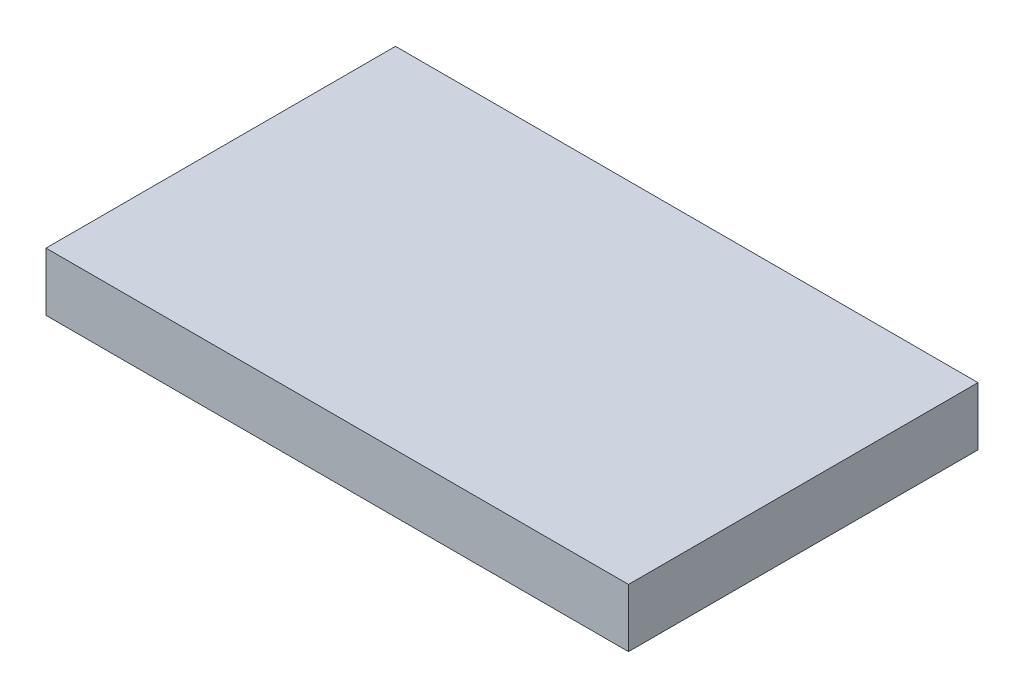
ISO-10303-21;
HEADER;
FILE_DESCRIPTION(('STEP AP214'),'2;1');
FILE_NAME('part.step','',(''),(''),'','','');
FILE_SCHEMA(('AUTOMOTIVE_DESIGN { 1 0 10303 214 1 1 1 1 }'));
ENDSEC;
DATA;
#1=APPLICATION_CONTEXT('core data for automotive mechanical design processes');
#2=APPLICATION_PROTOCOL_DEFINITION('international standard','automotive_design',2000,#1);
#3=PRODUCT_CONTEXT('',#1,'mechanical');
#4=PRODUCT('Part','Part','',(#3));
#5=PRODUCT_RELATED_PRODUCT_CATEGORY('part','',(#4));
#6=PRODUCT_DEFINITION_FORMATION('','',#4);
#7=PRODUCT_DEFINITION_CONTEXT('part definition',#1,'design');
#8=PRODUCT_DEFINITION('design','',#6,#7);
#9=PRODUCT_DEFINITION_SHAPE('','',#8);
#10=(LENGTH_UNIT() NAMED_UNIT(*) SI_UNIT(.MILLI.,.METRE.));
#11=(NAMED_UNIT(*) PLANE_ANGLE_UNIT() SI_UNIT($,.RADIAN.));
#12=(NAMED_UNIT(*) SI_UNIT($,.STERADIAN.) SOLID_ANGLE_UNIT());
#13=UNCERTAINTY_MEASURE_WITH_UNIT(LENGTH_MEASURE(1.E-05),#10,'distance_accuracy_value','');
#14=(GEOMETRIC_REPRESENTATION_CONTEXT(3) GLOBAL_UNCERTAINTY_ASSIGNED_CONTEXT((#13)) GLOBAL_UNIT_ASSIGNED_CONTEXT((#10,
#11,#12)) REPRESENTATION_CONTEXT('',''));
#15=CARTESIAN_POINT('',(0.,0.,0.));
#16=DIRECTION('',(0.,0.,1.));
#17=DIRECTION('',(1.,0.,0.));
#18=AXIS2_PLACEMENT_3D('',#15,#16,#17);
#19=CARTESIAN_POINT('',(50.,10.,30.));
#20=DIRECTION('',(-1.,0.,0.));
#21=DIRECTION('',(0.,0.,1.));
#22=AXIS2_PLACEMENT_3D('',#19,#20,#21);
#23=PLANE('',#22);
#24=DIRECTION('',(0.,0.,-1.));
#25=VECTOR('',#24,1.);
#26=CARTESIAN_POINT('',(50.,0.,30.));
#27=LINE('',#26,#25);
#28=CARTESIAN_POINT('',(50.,0.,30.));
#29=VERTEX_POINT('',#28);
#30=CARTESIAN_POINT('',(50.,0.,-30.));
#31=VERTEX_POINT('',#30);
#32=EDGE_CURVE('E113',#29,#31,#27,.T.);
#33=ORIENTED_EDGE('',*,*,#32,.T.);
#34=DIRECTION('',(0.,-1.,0.));
#35=VECTOR('',#34,1.);
#36=CARTESIAN_POINT('',(50.,10.,-30.));
#37=LINE('',#36,#35);
#38=CARTESIAN_POINT('',(50.,10.,-30.));
#39=VERTEX_POINT('',#38);
#40=EDGE_CURVE('E11',#39,#31,#37,.T.);
#41=ORIENTED_EDGE('',*,*,#40,.F.);
#42=DIRECTION('',(0.,0.,-1.));
#43=VECTOR('',#42,1.);
#44=CARTESIAN_POINT('',(50.,10.,30.));
#45=LINE('',#44,#43);
#46=CARTESIAN_POINT('',(50.,10.,30.));
#47=VERTEX_POINT('',#46);
#48=EDGE_CURVE('E97',#47,#39,#45,.T.);
#49=ORIENTED_EDGE('',*,*,#48,.F.);
#50=DIRECTION('',(0.,-1.,0.));
#51=VECTOR('',#50,1.);
#52=CARTESIAN_POINT('',(50.,10.,30.));
#53=LINE('',#52,#51);
#54=EDGE_CURVE('E109',#47,#29,#53,.T.);
#55=ORIENTED_EDGE('',*,*,#54,.T.);
#56=EDGE_LOOP('',(#33,#41,#49,#55));
#57=FACE_BOUND('',#56,.T.);
#58=ADVANCED_FACE('F45',(#57),#23,.F.);
#59=CARTESIAN_POINT('',(-50.,10.,-30.));
#60=DIRECTION('',(0.,0.,1.));
#61=DIRECTION('',(1.,0.,0.));
#62=AXIS2_PLACEMENT_3D('',#59,#60,#61);
#63=PLANE('',#62);
#64=DIRECTION('',(-1.,0.,0.));
#65=VECTOR('',#64,1.);
#66=CARTESIAN_POINT('',(-50.,0.,-30.));
#67=LINE('',#66,#65);
#68=CARTESIAN_POINT('',(-50.,0.,-30.));
#69=VERTEX_POINT('',#68);
#70=EDGE_CURVE('E102',#31,#69,#67,.T.);
#71=ORIENTED_EDGE('',*,*,#70,.T.);
#72=DIRECTION('',(0.,-1.,0.));
#73=VECTOR('',#72,1.);
#74=CARTESIAN_POINT('',(-50.,10.,-30.));
#75=LINE('',#74,#73);
#76=CARTESIAN_POINT('',(-50.,10.,-30.));
#77=VERTEX_POINT('',#76);
#78=EDGE_CURVE('E54',#77,#69,#75,.T.);
#79=ORIENTED_EDGE('',*,*,#78,.F.);
#80=DIRECTION('',(-1.,0.,0.));
#81=VECTOR('',#80,1.);
#82=CARTESIAN_POINT('',(-50.,10.,-30.));
#83=LINE('',#82,#81);
#84=EDGE_CURVE('E92',#39,#77,#83,.T.);
#85=ORIENTED_EDGE('',*,*,#84,.F.);
#86=ORIENTED_EDGE('',*,*,#40,.T.);
#87=EDGE_LOOP('',(#71,#79,#85,#86));
#88=FACE_BOUND('',#87,.T.);
#89=ADVANCED_FACE('F101',(#88),#63,.F.);
#90=CARTESIAN_POINT('',(-50.,10.,30.));
#91=DIRECTION('',(1.,0.,0.));
#92=DIRECTION('',(0.,0.,-1.));
#93=AXIS2_PLACEMENT_3D('',#90,#91,#92);
#94=PLANE('',#93);
#95=DIRECTION('',(0.,0.,1.));
#96=VECTOR('',#95,1.);
#97=CARTESIAN_POINT('',(-50.,0.,30.));
#98=LINE('',#97,#96);
#99=CARTESIAN_POINT('',(-50.,0.,30.));
#100=VERTEX_POINT('',#99);
#101=EDGE_CURVE('E79',#69,#100,#98,.T.);
#102=ORIENTED_EDGE('',*,*,#101,.T.);
#103=DIRECTION('',(0.,-1.,0.));
#104=VECTOR('',#103,1.);
#105=CARTESIAN_POINT('',(-50.,10.,30.));
#106=LINE('',#105,#104);
#107=CARTESIAN_POINT('',(-50.,10.,30.));
#108=VERTEX_POINT('',#107);
#109=EDGE_CURVE('E104',#108,#100,#106,.T.);
#110=ORIENTED_EDGE('',*,*,#109,.F.);
#111=DIRECTION('',(0.,0.,1.));
#112=VECTOR('',#111,1.);
#113=CARTESIAN_POINT('',(-50.,10.,30.));
#114=LINE('',#113,#112);
#115=EDGE_CURVE('E95',#77,#108,#114,.T.);
#116=ORIENTED_EDGE('',*,*,#115,.F.);
#117=ORIENTED_EDGE('',*,*,#78,.T.);
#118=EDGE_LOOP('',(#102,#110,#116,#117));
#119=FACE_BOUND('',#118,.T.);
#120=ADVANCED_FACE('F105',(#119),#94,.F.);
#121=CARTESIAN_POINT('',(-50.,10.,30.));
#122=DIRECTION('',(0.,0.,-1.));
#123=DIRECTION('',(-1.,0.,0.));
#124=AXIS2_PLACEMENT_3D('',#121,#122,#123);
#125=PLANE('',#124);
#126=DIRECTION('',(1.,0.,0.));
#127=VECTOR('',#126,1.);
#128=CARTESIAN_POINT('',(-50.,0.,30.));
#129=LINE('',#128,#127);
#130=EDGE_CURVE('E85',#100,#29,#129,.T.);
#131=ORIENTED_EDGE('',*,*,#130,.T.);
#132=ORIENTED_EDGE('',*,*,#54,.F.);
#133=DIRECTION('',(1.,0.,0.));
#134=VECTOR('',#133,1.);
#135=CARTESIAN_POINT('',(-50.,10.,30.));
#136=LINE('',#135,#134);
#137=EDGE_CURVE('E62',#108,#47,#136,.T.);
#138=ORIENTED_EDGE('',*,*,#137,.F.);
#139=ORIENTED_EDGE('',*,*,#109,.T.);
#140=EDGE_LOOP('',(#131,#132,#138,#139));
#141=FACE_BOUND('',#140,.T.);
#142=ADVANCED_FACE('F126',(#141),#125,.F.);
#143=CARTESIAN_POINT('',(0.,10.,0.));
#144=DIRECTION('',(0.,-1.,0.));
#145=DIRECTION('',(0.,0.,-1.));
#146=AXIS2_PLACEMENT_3D('',#143,#144,#145);
#147=PLANE('',#146);
#148=ORIENTED_EDGE('',*,*,#48,.T.);
#149=ORIENTED_EDGE('',*,*,#84,.T.);
#150=ORIENTED_EDGE('',*,*,#115,.T.);
#151=ORIENTED_EDGE('',*,*,#137,.T.);
#152=EDGE_LOOP('',(#148,#149,#150,#151));
#153=FACE_BOUND('',#152,.T.);
#154=ADVANCED_FACE('F93',(#153),#147,.F.);
#155=CARTESIAN_POINT('',(0.,0.,0.));
#156=DIRECTION('',(0.,-1.,0.));
#157=DIRECTION('',(0.,0.,-1.));
#158=AXIS2_PLACEMENT_3D('',#155,#156,#157);
#159=PLANE('',#158);
#160=ORIENTED_EDGE('',*,*,#32,.F.);
#161=ORIENTED_EDGE('',*,*,#130,.F.);
#162=ORIENTED_EDGE('',*,*,#101,.F.);
#163=ORIENTED_EDGE('',*,*,#70,.F.);
#164=EDGE_LOOP('',(#160,#161,#162,#163));
#165=FACE_BOUND('',#164,.T.);
#166=ADVANCED_FACE('F129',(#165),#159,.T.);
#167=CLOSED_SHELL('',(#58,#89,#120,#142,#154,#166));
#168=MANIFOLD_SOLID_BREP('B2',#167);
#169=ADVANCED_BREP_SHAPE_REPRESENTATION('',(#18,#168),#14);
#170=SHAPE_DEFINITION_REPRESENTATION(#9,#169);
ENDSEC;
END-ISO-10303-21;
